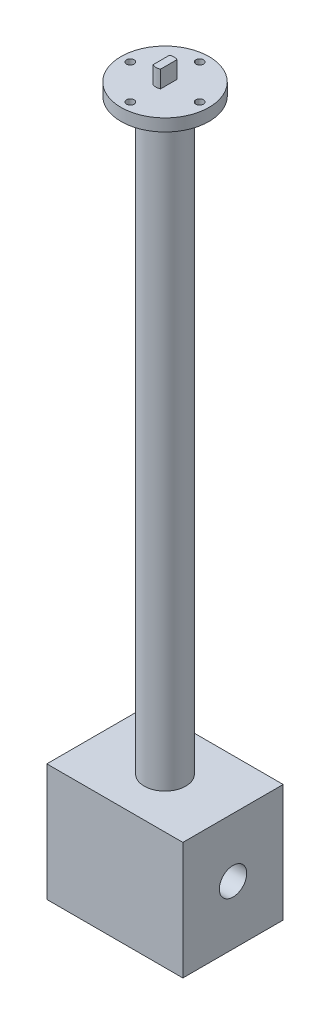
ISO-10303-21;
HEADER;
FILE_DESCRIPTION(('STEP AP214'),'2;1');
FILE_NAME('part.step','',(''),(''),'','','');
FILE_SCHEMA(('AUTOMOTIVE_DESIGN { 1 0 10303 214 1 1 1 1 }'));
ENDSEC;
DATA;
#1=APPLICATION_CONTEXT('core data for automotive mechanical design processes');
#2=APPLICATION_PROTOCOL_DEFINITION('international standard','automotive_design',2000,#1);
#3=PRODUCT_CONTEXT('',#1,'mechanical');
#4=PRODUCT('Part','Part','',(#3));
#5=PRODUCT_RELATED_PRODUCT_CATEGORY('part','',(#4));
#6=PRODUCT_DEFINITION_FORMATION('','',#4);
#7=PRODUCT_DEFINITION_CONTEXT('part definition',#1,'design');
#8=PRODUCT_DEFINITION('design','',#6,#7);
#9=PRODUCT_DEFINITION_SHAPE('','',#8);
#10=(LENGTH_UNIT() NAMED_UNIT(*) SI_UNIT(.MILLI.,.METRE.));
#11=(NAMED_UNIT(*) PLANE_ANGLE_UNIT() SI_UNIT($,.RADIAN.));
#12=(NAMED_UNIT(*) SI_UNIT($,.STERADIAN.) SOLID_ANGLE_UNIT());
#13=UNCERTAINTY_MEASURE_WITH_UNIT(LENGTH_MEASURE(1.E-05),#10,'distance_accuracy_value','');
#14=(GEOMETRIC_REPRESENTATION_CONTEXT(3) GLOBAL_UNCERTAINTY_ASSIGNED_CONTEXT((#13)) GLOBAL_UNIT_ASSIGNED_CONTEXT((#10,
#11,#12)) REPRESENTATION_CONTEXT('',''));
#15=CARTESIAN_POINT('',(0.,0.,0.));
#16=DIRECTION('',(0.,0.,1.));
#17=DIRECTION('',(1.,0.,0.));
#18=AXIS2_PLACEMENT_3D('',#15,#16,#17);
#19=CARTESIAN_POINT('',(0.,6.35,0.));
#20=DIRECTION('',(0.,1.,0.));
#21=DIRECTION('',(0.,0.,1.));
#22=AXIS2_PLACEMENT_3D('',#19,#20,#21);
#23=PLANE('',#22);
#24=CARTESIAN_POINT('',(18.,6.35,-1.88539992297529E-13));
#25=DIRECTION('',(0.,1.,0.));
#26=DIRECTION('',(0.,0.,1.));
#27=AXIS2_PLACEMENT_3D('',#24,#25,#26);
#28=CIRCLE('',#27,1.984375);
#29=CARTESIAN_POINT('',(18.,6.35,1.98437499999981));
#30=VERTEX_POINT('',#29);
#31=EDGE_CURVE('E125',#30,#30,#28,.T.);
#32=ORIENTED_EDGE('',*,*,#31,.F.);
#33=EDGE_LOOP('',(#32));
#34=FACE_BOUND('',#33,.T.);
#35=CARTESIAN_POINT('',(0.,6.35,18.));
#36=DIRECTION('',(0.,1.,0.));
#37=DIRECTION('',(0.,0.,1.));
#38=AXIS2_PLACEMENT_3D('',#35,#36,#37);
#39=CIRCLE('',#38,1.984375);
#40=CARTESIAN_POINT('',(0.,6.35,19.984375));
#41=VERTEX_POINT('',#40);
#42=EDGE_CURVE('E136',#41,#41,#39,.T.);
#43=ORIENTED_EDGE('',*,*,#42,.F.);
#44=EDGE_LOOP('',(#43));
#45=FACE_BOUND('',#44,.T.);
#46=CARTESIAN_POINT('',(-18.,6.35,0.));
#47=DIRECTION('',(0.,1.,0.));
#48=DIRECTION('',(0.,0.,1.));
#49=AXIS2_PLACEMENT_3D('',#46,#47,#48);
#50=CIRCLE('',#49,1.984375);
#51=CARTESIAN_POINT('',(-18.,6.35,1.98437500000006));
#52=VERTEX_POINT('',#51);
#53=EDGE_CURVE('E142',#52,#52,#50,.T.);
#54=ORIENTED_EDGE('',*,*,#53,.F.);
#55=EDGE_LOOP('',(#54));
#56=FACE_BOUND('',#55,.T.);
#57=CARTESIAN_POINT('',(0.,6.35,-18.));
#58=DIRECTION('',(0.,1.,0.));
#59=DIRECTION('',(0.,0.,1.));
#60=AXIS2_PLACEMENT_3D('',#57,#58,#59);
#61=CIRCLE('',#60,1.984375);
#62=CARTESIAN_POINT('',(0.,6.35,-16.015625));
#63=VERTEX_POINT('',#62);
#64=EDGE_CURVE('E148',#63,#63,#61,.T.);
#65=ORIENTED_EDGE('',*,*,#64,.F.);
#66=EDGE_LOOP('',(#65));
#67=FACE_BOUND('',#66,.T.);
#68=CARTESIAN_POINT('',(0.,6.35,0.));
#69=DIRECTION('',(0.,1.,0.));
#70=DIRECTION('',(0.,0.,1.));
#71=AXIS2_PLACEMENT_3D('',#68,#69,#70);
#72=CIRCLE('',#71,22.86);
#73=CARTESIAN_POINT('',(0.,6.35,22.86));
#74=VERTEX_POINT('',#73);
#75=EDGE_CURVE('E183',#74,#74,#72,.T.);
#76=ORIENTED_EDGE('',*,*,#75,.T.);
#77=EDGE_LOOP('',(#76));
#78=FACE_BOUND('',#77,.T.);
#79=CARTESIAN_POINT('',(0.,6.35,0.));
#80=DIRECTION('',(0.,1.,0.));
#81=DIRECTION('',(0.,0.,1.));
#82=AXIS2_PLACEMENT_3D('',#79,#80,#81);
#83=CIRCLE('',#82,4.699);
#84=CARTESIAN_POINT('',(1.9685,6.35,-4.26680310654242));
#85=VERTEX_POINT('',#84);
#86=CARTESIAN_POINT('',(-1.9685,6.35,-4.26680310654242));
#87=VERTEX_POINT('',#86);
#88=EDGE_CURVE('E166',#85,#87,#83,.T.);
#89=ORIENTED_EDGE('',*,*,#88,.F.);
#90=DIRECTION('',(0.,0.,1.));
#91=VECTOR('',#90,1.);
#92=CARTESIAN_POINT('',(1.9685,6.35,0.));
#93=LINE('',#92,#91);
#94=CARTESIAN_POINT('',(1.9685,6.35,4.26680310654242));
#95=VERTEX_POINT('',#94);
#96=EDGE_CURVE('E51',#85,#95,#93,.T.);
#97=ORIENTED_EDGE('',*,*,#96,.T.);
#98=CARTESIAN_POINT('',(-1.9685,6.35,4.26680310654241));
#99=VERTEX_POINT('',#98);
#100=EDGE_CURVE('E56',#99,#95,#83,.T.);
#101=ORIENTED_EDGE('',*,*,#100,.F.);
#102=DIRECTION('',(0.,0.,1.));
#103=VECTOR('',#102,1.);
#104=CARTESIAN_POINT('',(-1.9685,6.35,0.));
#105=LINE('',#104,#103);
#106=EDGE_CURVE('E169',#87,#99,#105,.T.);
#107=ORIENTED_EDGE('',*,*,#106,.F.);
#108=EDGE_LOOP('',(#89,#97,#101,#107));
#109=FACE_BOUND('',#108,.T.);
#110=ADVANCED_FACE('F36',(#34,#45,#56,#67,#78,#109),#23,.T.);
#111=CARTESIAN_POINT('',(0.,6.35,0.));
#112=DIRECTION('',(0.,-1.,0.));
#113=DIRECTION('',(0.,0.,-1.));
#114=AXIS2_PLACEMENT_3D('',#111,#112,#113);
#115=CYLINDRICAL_SURFACE('',#114,22.86);
#116=ORIENTED_EDGE('',*,*,#75,.F.);
#117=EDGE_LOOP('',(#116));
#118=FACE_BOUND('',#117,.T.);
#119=CARTESIAN_POINT('',(0.,0.,0.));
#120=DIRECTION('',(0.,1.,0.));
#121=DIRECTION('',(0.,0.,1.));
#122=AXIS2_PLACEMENT_3D('',#119,#120,#121);
#123=CIRCLE('',#122,22.86);
#124=CARTESIAN_POINT('',(0.,0.,22.86));
#125=VERTEX_POINT('',#124);
#126=EDGE_CURVE('E182',#125,#125,#123,.T.);
#127=ORIENTED_EDGE('',*,*,#126,.T.);
#128=EDGE_LOOP('',(#127));
#129=FACE_BOUND('',#128,.T.);
#130=ADVANCED_FACE('F207',(#118,#129),#115,.T.);
#131=CARTESIAN_POINT('',(0.,0.,0.));
#132=DIRECTION('',(0.,1.,0.));
#133=DIRECTION('',(0.,0.,1.));
#134=AXIS2_PLACEMENT_3D('',#131,#132,#133);
#135=PLANE('',#134);
#136=CARTESIAN_POINT('',(18.,0.,-1.88539992297529E-13));
#137=DIRECTION('',(0.,1.,0.));
#138=DIRECTION('',(0.,0.,1.));
#139=AXIS2_PLACEMENT_3D('',#136,#137,#138);
#140=CIRCLE('',#139,1.984375);
#141=CARTESIAN_POINT('',(18.,0.,1.98437499999981));
#142=VERTEX_POINT('',#141);
#143=EDGE_CURVE('E128',#142,#142,#140,.T.);
#144=ORIENTED_EDGE('',*,*,#143,.T.);
#145=EDGE_LOOP('',(#144));
#146=FACE_BOUND('',#145,.T.);
#147=CARTESIAN_POINT('',(0.,0.,18.));
#148=DIRECTION('',(0.,1.,0.));
#149=DIRECTION('',(0.,0.,1.));
#150=AXIS2_PLACEMENT_3D('',#147,#148,#149);
#151=CIRCLE('',#150,1.984375);
#152=CARTESIAN_POINT('',(0.,0.,19.984375));
#153=VERTEX_POINT('',#152);
#154=EDGE_CURVE('E139',#153,#153,#151,.T.);
#155=ORIENTED_EDGE('',*,*,#154,.T.);
#156=EDGE_LOOP('',(#155));
#157=FACE_BOUND('',#156,.T.);
#158=CARTESIAN_POINT('',(-18.,0.,0.));
#159=DIRECTION('',(0.,1.,0.));
#160=DIRECTION('',(0.,0.,1.));
#161=AXIS2_PLACEMENT_3D('',#158,#159,#160);
#162=CIRCLE('',#161,1.984375);
#163=CARTESIAN_POINT('',(-18.,0.,1.98437500000006));
#164=VERTEX_POINT('',#163);
#165=EDGE_CURVE('E145',#164,#164,#162,.T.);
#166=ORIENTED_EDGE('',*,*,#165,.T.);
#167=EDGE_LOOP('',(#166));
#168=FACE_BOUND('',#167,.T.);
#169=CARTESIAN_POINT('',(0.,0.,-18.));
#170=DIRECTION('',(0.,1.,0.));
#171=DIRECTION('',(0.,0.,1.));
#172=AXIS2_PLACEMENT_3D('',#169,#170,#171);
#173=CIRCLE('',#172,1.984375);
#174=CARTESIAN_POINT('',(0.,0.,-16.015625));
#175=VERTEX_POINT('',#174);
#176=EDGE_CURVE('E151',#175,#175,#173,.T.);
#177=ORIENTED_EDGE('',*,*,#176,.T.);
#178=EDGE_LOOP('',(#177));
#179=FACE_BOUND('',#178,.T.);
#180=CARTESIAN_POINT('',(0.,0.,0.));
#181=DIRECTION('',(0.,1.,0.));
#182=DIRECTION('',(0.,0.,1.));
#183=AXIS2_PLACEMENT_3D('',#180,#181,#182);
#184=CIRCLE('',#183,14.6050000000003);
#185=CARTESIAN_POINT('',(0.,0.,14.6050000000003));
#186=VERTEX_POINT('',#185);
#187=EDGE_CURVE('E11',#186,#186,#184,.T.);
#188=ORIENTED_EDGE('',*,*,#187,.T.);
#189=EDGE_LOOP('',(#188));
#190=FACE_BOUND('',#189,.T.);
#191=ORIENTED_EDGE('',*,*,#126,.F.);
#192=EDGE_LOOP('',(#191));
#193=FACE_BOUND('',#192,.T.);
#194=ADVANCED_FACE('F213',(#146,#157,#168,#179,#190,#193),#135,.F.);
#195=CARTESIAN_POINT('',(1.9685,15.24,0.));
#196=DIRECTION('',(1.,0.,0.));
#197=DIRECTION('',(0.,0.,-1.));
#198=AXIS2_PLACEMENT_3D('',#195,#196,#197);
#199=PLANE('',#198);
#200=ORIENTED_EDGE('',*,*,#96,.F.);
#201=DIRECTION('',(0.,-1.,0.));
#202=VECTOR('',#201,1.);
#203=CARTESIAN_POINT('',(1.9685,15.24,-4.26680310654242));
#204=LINE('',#203,#202);
#205=CARTESIAN_POINT('',(1.9685,15.24,-4.26680310654242));
#206=VERTEX_POINT('',#205);
#207=EDGE_CURVE('E179',#206,#85,#204,.T.);
#208=ORIENTED_EDGE('',*,*,#207,.F.);
#209=DIRECTION('',(0.,0.,1.));
#210=VECTOR('',#209,1.);
#211=CARTESIAN_POINT('',(1.9685,15.24,0.));
#212=LINE('',#211,#210);
#213=CARTESIAN_POINT('',(1.9685,15.24,4.26680310654242));
#214=VERTEX_POINT('',#213);
#215=EDGE_CURVE('E157',#206,#214,#212,.T.);
#216=ORIENTED_EDGE('',*,*,#215,.T.);
#217=DIRECTION('',(0.,-1.,0.));
#218=VECTOR('',#217,1.);
#219=CARTESIAN_POINT('',(1.9685,15.24,4.26680310654242));
#220=LINE('',#219,#218);
#221=EDGE_CURVE('E171',#214,#95,#220,.T.);
#222=ORIENTED_EDGE('',*,*,#221,.T.);
#223=EDGE_LOOP('',(#200,#208,#216,#222));
#224=FACE_BOUND('',#223,.T.);
#225=ADVANCED_FACE('F219',(#224),#199,.T.);
#226=CARTESIAN_POINT('',(0.,15.24,0.));
#227=DIRECTION('',(0.,-1.,0.));
#228=DIRECTION('',(0.,0.,-1.));
#229=AXIS2_PLACEMENT_3D('',#226,#227,#228);
#230=CYLINDRICAL_SURFACE('',#229,4.699);
#231=ORIENTED_EDGE('',*,*,#88,.T.);
#232=DIRECTION('',(0.,-1.,0.));
#233=VECTOR('',#232,1.);
#234=CARTESIAN_POINT('',(-1.9685,15.24,-4.26680310654242));
#235=LINE('',#234,#233);
#236=CARTESIAN_POINT('',(-1.9685,15.24,-4.26680310654242));
#237=VERTEX_POINT('',#236);
#238=EDGE_CURVE('E176',#237,#87,#235,.T.);
#239=ORIENTED_EDGE('',*,*,#238,.F.);
#240=CARTESIAN_POINT('',(0.,15.24,0.));
#241=DIRECTION('',(0.,1.,0.));
#242=DIRECTION('',(0.,0.,1.));
#243=AXIS2_PLACEMENT_3D('',#240,#241,#242);
#244=CIRCLE('',#243,4.699);
#245=EDGE_CURVE('E160',#206,#237,#244,.T.);
#246=ORIENTED_EDGE('',*,*,#245,.F.);
#247=ORIENTED_EDGE('',*,*,#207,.T.);
#248=EDGE_LOOP('',(#231,#239,#246,#247));
#249=FACE_BOUND('',#248,.T.);
#250=ADVANCED_FACE('F226',(#249),#230,.T.);
#251=CARTESIAN_POINT('',(-1.9685,15.24,0.));
#252=DIRECTION('',(1.,0.,0.));
#253=DIRECTION('',(0.,0.,-1.));
#254=AXIS2_PLACEMENT_3D('',#251,#252,#253);
#255=PLANE('',#254);
#256=ORIENTED_EDGE('',*,*,#106,.T.);
#257=DIRECTION('',(0.,-1.,0.));
#258=VECTOR('',#257,1.);
#259=CARTESIAN_POINT('',(-1.9685,15.24,4.26680310654241));
#260=LINE('',#259,#258);
#261=CARTESIAN_POINT('',(-1.9685,15.24,4.26680310654241));
#262=VERTEX_POINT('',#261);
#263=EDGE_CURVE('E173',#262,#99,#260,.T.);
#264=ORIENTED_EDGE('',*,*,#263,.F.);
#265=DIRECTION('',(0.,0.,1.));
#266=VECTOR('',#265,1.);
#267=CARTESIAN_POINT('',(-1.9685,15.24,0.));
#268=LINE('',#267,#266);
#269=EDGE_CURVE('E162',#237,#262,#268,.T.);
#270=ORIENTED_EDGE('',*,*,#269,.F.);
#271=ORIENTED_EDGE('',*,*,#238,.T.);
#272=EDGE_LOOP('',(#256,#264,#270,#271));
#273=FACE_BOUND('',#272,.T.);
#274=ADVANCED_FACE('F255',(#273),#255,.F.);
#275=ORIENTED_EDGE('',*,*,#100,.T.);
#276=ORIENTED_EDGE('',*,*,#221,.F.);
#277=EDGE_CURVE('E163',#262,#214,#244,.T.);
#278=ORIENTED_EDGE('',*,*,#277,.F.);
#279=ORIENTED_EDGE('',*,*,#263,.T.);
#280=EDGE_LOOP('',(#275,#276,#278,#279));
#281=FACE_BOUND('',#280,.T.);
#282=ADVANCED_FACE('F251',(#281),#230,.T.);
#283=CARTESIAN_POINT('',(0.,15.24,0.));
#284=DIRECTION('',(0.,1.,0.));
#285=DIRECTION('',(0.,0.,1.));
#286=AXIS2_PLACEMENT_3D('',#283,#284,#285);
#287=PLANE('',#286);
#288=ORIENTED_EDGE('',*,*,#215,.F.);
#289=ORIENTED_EDGE('',*,*,#245,.T.);
#290=ORIENTED_EDGE('',*,*,#269,.T.);
#291=ORIENTED_EDGE('',*,*,#277,.T.);
#292=EDGE_LOOP('',(#288,#289,#290,#291));
#293=FACE_BOUND('',#292,.T.);
#294=ADVANCED_FACE('F203',(#293),#287,.T.);
#295=CARTESIAN_POINT('',(0.,-304.8,0.));
#296=DIRECTION('',(0.,1.,0.));
#297=DIRECTION('',(0.,0.,1.));
#298=AXIS2_PLACEMENT_3D('',#295,#296,#297);
#299=CYLINDRICAL_SURFACE('',#298,10.795);
#300=CARTESIAN_POINT('',(0.,-3.81000000000037,0.));
#301=DIRECTION('',(0.,1.,0.));
#302=DIRECTION('',(0.,0.,1.));
#303=AXIS2_PLACEMENT_3D('',#300,#301,#302);
#304=CIRCLE('',#303,10.795);
#305=CARTESIAN_POINT('',(0.,-3.81000000000037,10.795));
#306=VERTEX_POINT('',#305);
#307=EDGE_CURVE('E44',#306,#306,#304,.F.);
#308=ORIENTED_EDGE('',*,*,#307,.T.);
#309=EDGE_LOOP('',(#308));
#310=FACE_BOUND('',#309,.T.);
#311=CARTESIAN_POINT('',(0.,-304.8,0.));
#312=DIRECTION('',(0.,-1.,0.));
#313=DIRECTION('',(0.,0.,-1.));
#314=AXIS2_PLACEMENT_3D('',#311,#312,#313);
#315=CIRCLE('',#314,10.795);
#316=CARTESIAN_POINT('',(0.,-304.8,-10.795));
#317=VERTEX_POINT('',#316);
#318=EDGE_CURVE('E154',#317,#317,#315,.T.);
#319=ORIENTED_EDGE('',*,*,#318,.F.);
#320=EDGE_LOOP('',(#319));
#321=FACE_BOUND('',#320,.T.);
#322=ADVANCED_FACE('F190',(#310,#321),#299,.T.);
#323=CARTESIAN_POINT('',(0.,-3.81000000000031,0.));
#324=DIRECTION('',(0.,1.,0.));
#325=DIRECTION('',(0.,0.,1.));
#326=AXIS2_PLACEMENT_3D('',#323,#324,#325);
#327=CONICAL_SURFACE('',#326,10.795,0.785398163397448);
#328=ORIENTED_EDGE('',*,*,#187,.F.);
#329=EDGE_LOOP('',(#328));
#330=FACE_BOUND('',#329,.T.);
#331=ORIENTED_EDGE('',*,*,#307,.F.);
#332=EDGE_LOOP('',(#331));
#333=FACE_BOUND('',#332,.T.);
#334=ADVANCED_FACE('F38',(#330,#333),#327,.T.);
#335=CARTESIAN_POINT('',(0.,6.35,-18.));
#336=DIRECTION('',(0.,1.,0.));
#337=DIRECTION('',(0.,0.,1.));
#338=AXIS2_PLACEMENT_3D('',#335,#336,#337);
#339=CYLINDRICAL_SURFACE('',#338,1.984375);
#340=ORIENTED_EDGE('',*,*,#176,.F.);
#341=EDGE_LOOP('',(#340));
#342=FACE_BOUND('',#341,.T.);
#343=ORIENTED_EDGE('',*,*,#64,.T.);
#344=EDGE_LOOP('',(#343));
#345=FACE_BOUND('',#344,.T.);
#346=ADVANCED_FACE('F194',(#342,#345),#339,.F.);
#347=CARTESIAN_POINT('',(-18.,6.35,0.));
#348=DIRECTION('',(0.,1.,0.));
#349=DIRECTION('',(0.,0.,1.));
#350=AXIS2_PLACEMENT_3D('',#347,#348,#349);
#351=CYLINDRICAL_SURFACE('',#350,1.984375);
#352=ORIENTED_EDGE('',*,*,#165,.F.);
#353=EDGE_LOOP('',(#352));
#354=FACE_BOUND('',#353,.T.);
#355=ORIENTED_EDGE('',*,*,#53,.T.);
#356=EDGE_LOOP('',(#355));
#357=FACE_BOUND('',#356,.T.);
#358=ADVANCED_FACE('F200',(#354,#357),#351,.F.);
#359=CARTESIAN_POINT('',(0.,6.35,18.));
#360=DIRECTION('',(0.,1.,0.));
#361=DIRECTION('',(0.,0.,1.));
#362=AXIS2_PLACEMENT_3D('',#359,#360,#361);
#363=CYLINDRICAL_SURFACE('',#362,1.984375);
#364=ORIENTED_EDGE('',*,*,#154,.F.);
#365=EDGE_LOOP('',(#364));
#366=FACE_BOUND('',#365,.T.);
#367=ORIENTED_EDGE('',*,*,#42,.T.);
#368=EDGE_LOOP('',(#367));
#369=FACE_BOUND('',#368,.T.);
#370=ADVANCED_FACE('F328',(#366,#369),#363,.F.);
#371=CARTESIAN_POINT('',(18.,6.35,-1.88539992297529E-13));
#372=DIRECTION('',(0.,1.,0.));
#373=DIRECTION('',(0.,0.,1.));
#374=AXIS2_PLACEMENT_3D('',#371,#372,#373);
#375=CYLINDRICAL_SURFACE('',#374,1.984375);
#376=ORIENTED_EDGE('',*,*,#143,.F.);
#377=EDGE_LOOP('',(#376));
#378=FACE_BOUND('',#377,.T.);
#379=ORIENTED_EDGE('',*,*,#31,.T.);
#380=EDGE_LOOP('',(#379));
#381=FACE_BOUND('',#380,.T.);
#382=ADVANCED_FACE('F335',(#378,#381),#375,.F.);
#383=CARTESIAN_POINT('',(-35.306,-365.76,26.035));
#384=DIRECTION('',(1.,0.,0.));
#385=DIRECTION('',(0.,0.,-1.));
#386=AXIS2_PLACEMENT_3D('',#383,#384,#385);
#387=PLANE('',#386);
#388=CARTESIAN_POINT('',(-35.306,-335.28,0.));
#389=DIRECTION('',(1.,0.,0.));
#390=DIRECTION('',(0.,0.,-1.));
#391=AXIS2_PLACEMENT_3D('',#388,#389,#390);
#392=CIRCLE('',#391,7.11199999999999);
#393=CARTESIAN_POINT('',(-35.306,-335.28,-7.112));
#394=VERTEX_POINT('',#393);
#395=EDGE_CURVE('E420',#394,#394,#392,.T.);
#396=ORIENTED_EDGE('',*,*,#395,.T.);
#397=EDGE_LOOP('',(#396));
#398=FACE_BOUND('',#397,.T.);
#399=DIRECTION('',(0.,0.,-1.));
#400=VECTOR('',#399,1.);
#401=CARTESIAN_POINT('',(-35.306,-304.8,26.035));
#402=LINE('',#401,#400);
#403=CARTESIAN_POINT('',(-35.306,-304.8,26.035));
#404=VERTEX_POINT('',#403);
#405=CARTESIAN_POINT('',(-35.306,-304.8,-26.035));
#406=VERTEX_POINT('',#405);
#407=EDGE_CURVE('E124',#404,#406,#402,.T.);
#408=ORIENTED_EDGE('',*,*,#407,.T.);
#409=DIRECTION('',(0.,1.,0.));
#410=VECTOR('',#409,1.);
#411=CARTESIAN_POINT('',(-35.306,-365.76,-26.035));
#412=LINE('',#411,#410);
#413=CARTESIAN_POINT('',(-35.306,-365.76,-26.035));
#414=VERTEX_POINT('',#413);
#415=EDGE_CURVE('E104',#414,#406,#412,.T.);
#416=ORIENTED_EDGE('',*,*,#415,.F.);
#417=DIRECTION('',(0.,0.,-1.));
#418=VECTOR('',#417,1.);
#419=CARTESIAN_POINT('',(-35.306,-365.76,26.035));
#420=LINE('',#419,#418);
#421=CARTESIAN_POINT('',(-35.306,-365.76,26.035));
#422=VERTEX_POINT('',#421);
#423=EDGE_CURVE('E111',#422,#414,#420,.T.);
#424=ORIENTED_EDGE('',*,*,#423,.F.);
#425=DIRECTION('',(0.,1.,0.));
#426=VECTOR('',#425,1.);
#427=CARTESIAN_POINT('',(-35.306,-365.76,26.035));
#428=LINE('',#427,#426);
#429=EDGE_CURVE('E429',#422,#404,#428,.T.);
#430=ORIENTED_EDGE('',*,*,#429,.T.);
#431=EDGE_LOOP('',(#408,#416,#424,#430));
#432=FACE_BOUND('',#431,.T.);
#433=ADVANCED_FACE('F122',(#398,#432),#387,.F.);
#434=CARTESIAN_POINT('',(-35.306,-365.76,-26.035));
#435=DIRECTION('',(0.,0.,1.));
#436=DIRECTION('',(1.,0.,0.));
#437=AXIS2_PLACEMENT_3D('',#434,#435,#436);
#438=PLANE('',#437);
#439=DIRECTION('',(1.,0.,0.));
#440=VECTOR('',#439,1.);
#441=CARTESIAN_POINT('',(-35.306,-304.8,-26.035));
#442=LINE('',#441,#440);
#443=CARTESIAN_POINT('',(35.306,-304.8,-26.035));
#444=VERTEX_POINT('',#443);
#445=EDGE_CURVE('E431',#406,#444,#442,.T.);
#446=ORIENTED_EDGE('',*,*,#445,.T.);
#447=DIRECTION('',(0.,1.,0.));
#448=VECTOR('',#447,1.);
#449=CARTESIAN_POINT('',(35.306,-365.76,-26.035));
#450=LINE('',#449,#448);
#451=CARTESIAN_POINT('',(35.306,-365.76,-26.035));
#452=VERTEX_POINT('',#451);
#453=EDGE_CURVE('E107',#452,#444,#450,.T.);
#454=ORIENTED_EDGE('',*,*,#453,.F.);
#455=DIRECTION('',(1.,0.,0.));
#456=VECTOR('',#455,1.);
#457=CARTESIAN_POINT('',(-35.306,-365.76,-26.035));
#458=LINE('',#457,#456);
#459=EDGE_CURVE('E100',#414,#452,#458,.T.);
#460=ORIENTED_EDGE('',*,*,#459,.F.);
#461=ORIENTED_EDGE('',*,*,#415,.T.);
#462=EDGE_LOOP('',(#446,#454,#460,#461));
#463=FACE_BOUND('',#462,.T.);
#464=ADVANCED_FACE('F102',(#463),#438,.F.);
#465=CARTESIAN_POINT('',(35.306,-365.76,26.035));
#466=DIRECTION('',(-1.,0.,0.));
#467=DIRECTION('',(0.,0.,1.));
#468=AXIS2_PLACEMENT_3D('',#465,#466,#467);
#469=PLANE('',#468);
#470=CARTESIAN_POINT('',(35.306,-335.28,0.));
#471=DIRECTION('',(1.,0.,0.));
#472=DIRECTION('',(0.,0.,-1.));
#473=AXIS2_PLACEMENT_3D('',#470,#471,#472);
#474=CIRCLE('',#473,7.11199999999999);
#475=CARTESIAN_POINT('',(35.306,-335.28,-7.112));
#476=VERTEX_POINT('',#475);
#477=EDGE_CURVE('E423',#476,#476,#474,.T.);
#478=ORIENTED_EDGE('',*,*,#477,.F.);
#479=EDGE_LOOP('',(#478));
#480=FACE_BOUND('',#479,.T.);
#481=DIRECTION('',(0.,0.,1.));
#482=VECTOR('',#481,1.);
#483=CARTESIAN_POINT('',(35.306,-304.8,26.035));
#484=LINE('',#483,#482);
#485=CARTESIAN_POINT('',(35.306,-304.8,26.035));
#486=VERTEX_POINT('',#485);
#487=EDGE_CURVE('E433',#444,#486,#484,.T.);
#488=ORIENTED_EDGE('',*,*,#487,.T.);
#489=DIRECTION('',(0.,1.,0.));
#490=VECTOR('',#489,1.);
#491=CARTESIAN_POINT('',(35.306,-365.76,26.035));
#492=LINE('',#491,#490);
#493=CARTESIAN_POINT('',(35.306,-365.76,26.035));
#494=VERTEX_POINT('',#493);
#495=EDGE_CURVE('E130',#494,#486,#492,.T.);
#496=ORIENTED_EDGE('',*,*,#495,.F.);
#497=DIRECTION('',(0.,0.,1.));
#498=VECTOR('',#497,1.);
#499=CARTESIAN_POINT('',(35.306,-365.76,26.035));
#500=LINE('',#499,#498);
#501=EDGE_CURVE('E110',#452,#494,#500,.T.);
#502=ORIENTED_EDGE('',*,*,#501,.F.);
#503=ORIENTED_EDGE('',*,*,#453,.T.);
#504=EDGE_LOOP('',(#488,#496,#502,#503));
#505=FACE_BOUND('',#504,.T.);
#506=ADVANCED_FACE('F359',(#480,#505),#469,.F.);
#507=CARTESIAN_POINT('',(-35.306,-365.76,26.035));
#508=DIRECTION('',(0.,0.,-1.));
#509=DIRECTION('',(-1.,0.,0.));
#510=AXIS2_PLACEMENT_3D('',#507,#508,#509);
#511=PLANE('',#510);
#512=DIRECTION('',(-1.,0.,0.));
#513=VECTOR('',#512,1.);
#514=CARTESIAN_POINT('',(-35.306,-304.8,26.035));
#515=LINE('',#514,#513);
#516=EDGE_CURVE('E120',#486,#404,#515,.T.);
#517=ORIENTED_EDGE('',*,*,#516,.T.);
#518=ORIENTED_EDGE('',*,*,#429,.F.);
#519=DIRECTION('',(-1.,0.,0.));
#520=VECTOR('',#519,1.);
#521=CARTESIAN_POINT('',(-35.306,-365.76,26.035));
#522=LINE('',#521,#520);
#523=EDGE_CURVE('E116',#494,#422,#522,.T.);
#524=ORIENTED_EDGE('',*,*,#523,.F.);
#525=ORIENTED_EDGE('',*,*,#495,.T.);
#526=EDGE_LOOP('',(#517,#518,#524,#525));
#527=FACE_BOUND('',#526,.T.);
#528=ADVANCED_FACE('F366',(#527),#511,.F.);
#529=CARTESIAN_POINT('',(0.,-365.76,0.));
#530=DIRECTION('',(0.,-1.,0.));
#531=DIRECTION('',(0.,0.,-1.));
#532=AXIS2_PLACEMENT_3D('',#529,#530,#531);
#533=PLANE('',#532);
#534=ORIENTED_EDGE('',*,*,#423,.T.);
#535=ORIENTED_EDGE('',*,*,#459,.T.);
#536=ORIENTED_EDGE('',*,*,#501,.T.);
#537=ORIENTED_EDGE('',*,*,#523,.T.);
#538=EDGE_LOOP('',(#534,#535,#536,#537));
#539=FACE_BOUND('',#538,.T.);
#540=ADVANCED_FACE('F114',(#539),#533,.T.);
#541=CARTESIAN_POINT('',(0.,-304.8,0.));
#542=DIRECTION('',(0.,-1.,0.));
#543=DIRECTION('',(0.,0.,-1.));
#544=AXIS2_PLACEMENT_3D('',#541,#542,#543);
#545=PLANE('',#544);
#546=ORIENTED_EDGE('',*,*,#318,.T.);
#547=EDGE_LOOP('',(#546));
#548=FACE_BOUND('',#547,.T.);
#549=ORIENTED_EDGE('',*,*,#407,.F.);
#550=ORIENTED_EDGE('',*,*,#516,.F.);
#551=ORIENTED_EDGE('',*,*,#487,.F.);
#552=ORIENTED_EDGE('',*,*,#445,.F.);
#553=EDGE_LOOP('',(#549,#550,#551,#552));
#554=FACE_BOUND('',#553,.T.);
#555=ADVANCED_FACE('F381',(#548,#554),#545,.F.);
#556=CARTESIAN_POINT('',(-35.306,-335.28,0.));
#557=DIRECTION('',(1.,0.,0.));
#558=DIRECTION('',(0.,0.,-1.));
#559=AXIS2_PLACEMENT_3D('',#556,#557,#558);
#560=CYLINDRICAL_SURFACE('',#559,7.11199999999999);
#561=ORIENTED_EDGE('',*,*,#395,.F.);
#562=EDGE_LOOP('',(#561));
#563=FACE_BOUND('',#562,.T.);
#564=ORIENTED_EDGE('',*,*,#477,.T.);
#565=EDGE_LOOP('',(#564));
#566=FACE_BOUND('',#565,.T.);
#567=ADVANCED_FACE('F387',(#563,#566),#560,.F.);
#568=CLOSED_SHELL('',(#110,#130,#194,#225,#250,#274,#282,#294,#322,#334,#346,#358,#370,#382,
#433,#464,#506,#528,#540,#555,#567));
#569=MANIFOLD_SOLID_BREP('B2',#568);
#570=ADVANCED_BREP_SHAPE_REPRESENTATION('',(#18,#569),#14);
#571=SHAPE_DEFINITION_REPRESENTATION(#9,#570);
ENDSEC;
END-ISO-10303-21;
